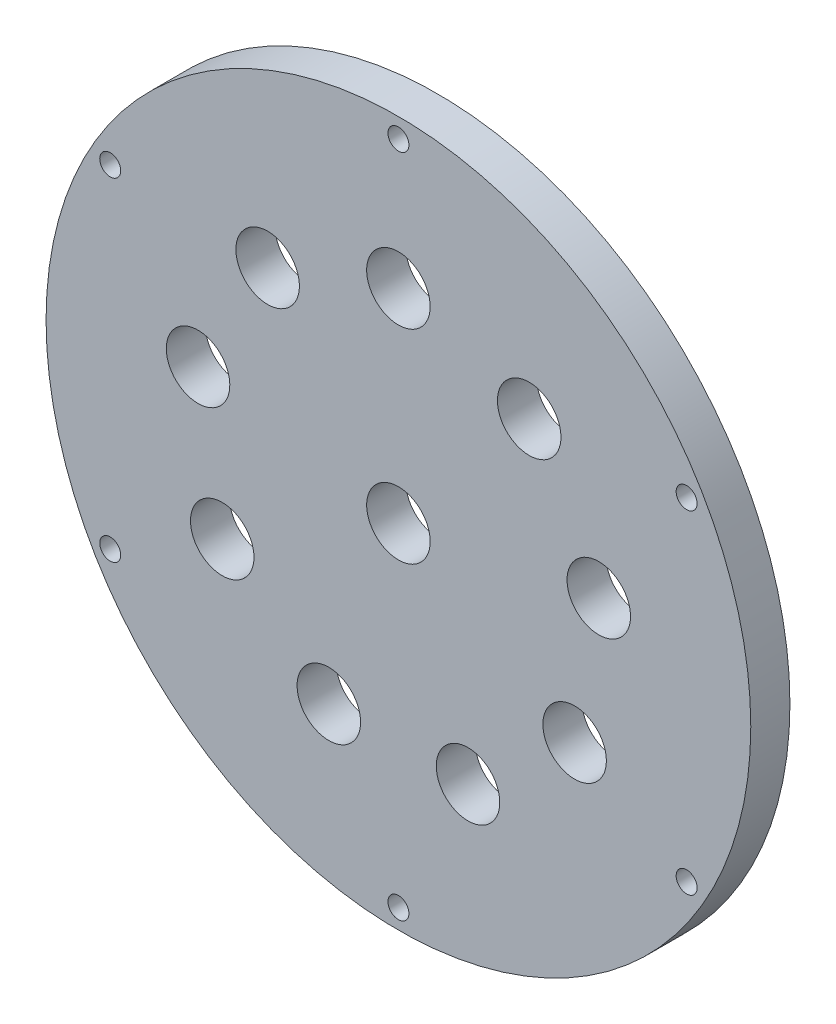
ISO-10303-21;
HEADER;
FILE_DESCRIPTION(('STEP AP214'),'2;1');
FILE_NAME('part.step','',(''),(''),'','','');
FILE_SCHEMA(('AUTOMOTIVE_DESIGN { 1 0 10303 214 1 1 1 1 }'));
ENDSEC;
DATA;
#1=APPLICATION_CONTEXT('core data for automotive mechanical design processes');
#2=APPLICATION_PROTOCOL_DEFINITION('international standard','automotive_design',2000,#1);
#3=PRODUCT_CONTEXT('',#1,'mechanical');
#4=PRODUCT('Part','Part','',(#3));
#5=PRODUCT_RELATED_PRODUCT_CATEGORY('part','',(#4));
#6=PRODUCT_DEFINITION_FORMATION('','',#4);
#7=PRODUCT_DEFINITION_CONTEXT('part definition',#1,'design');
#8=PRODUCT_DEFINITION('design','',#6,#7);
#9=PRODUCT_DEFINITION_SHAPE('','',#8);
#10=(LENGTH_UNIT() NAMED_UNIT(*) SI_UNIT(.MILLI.,.METRE.));
#11=(NAMED_UNIT(*) PLANE_ANGLE_UNIT() SI_UNIT($,.RADIAN.));
#12=(NAMED_UNIT(*) SI_UNIT($,.STERADIAN.) SOLID_ANGLE_UNIT());
#13=UNCERTAINTY_MEASURE_WITH_UNIT(LENGTH_MEASURE(1.E-05),#10,'distance_accuracy_value','');
#14=(GEOMETRIC_REPRESENTATION_CONTEXT(3) GLOBAL_UNCERTAINTY_ASSIGNED_CONTEXT((#13)) GLOBAL_UNIT_ASSIGNED_CONTEXT((#10,
#11,#12)) REPRESENTATION_CONTEXT('',''));
#15=CARTESIAN_POINT('',(0.,0.,0.));
#16=DIRECTION('',(0.,0.,1.));
#17=DIRECTION('',(1.,0.,0.));
#18=AXIS2_PLACEMENT_3D('',#15,#16,#17);
#19=CARTESIAN_POINT('',(0.,0.,6.35));
#20=DIRECTION('',(0.,0.,-1.));
#21=DIRECTION('',(-1.,0.,0.));
#22=AXIS2_PLACEMENT_3D('',#19,#20,#21);
#23=CYLINDRICAL_SURFACE('',#22,57.15);
#24=CARTESIAN_POINT('',(0.,0.,6.35));
#25=DIRECTION('',(0.,0.,1.));
#26=DIRECTION('',(1.,0.,0.));
#27=AXIS2_PLACEMENT_3D('',#24,#25,#26);
#28=CIRCLE('',#27,57.15);
#29=CARTESIAN_POINT('',(57.15,0.,6.35));
#30=VERTEX_POINT('',#29);
#31=EDGE_CURVE('E10',#30,#30,#28,.T.);
#32=ORIENTED_EDGE('',*,*,#31,.F.);
#33=EDGE_LOOP('',(#32));
#34=FACE_BOUND('',#33,.T.);
#35=CARTESIAN_POINT('',(0.,0.,0.));
#36=DIRECTION('',(0.,0.,1.));
#37=DIRECTION('',(1.,0.,0.));
#38=AXIS2_PLACEMENT_3D('',#35,#36,#37);
#39=CIRCLE('',#38,57.15);
#40=CARTESIAN_POINT('',(57.15,0.,0.));
#41=VERTEX_POINT('',#40);
#42=EDGE_CURVE('E44',#41,#41,#39,.T.);
#43=ORIENTED_EDGE('',*,*,#42,.T.);
#44=EDGE_LOOP('',(#43));
#45=FACE_BOUND('',#44,.T.);
#46=ADVANCED_FACE('F41',(#34,#45),#23,.T.);
#47=CARTESIAN_POINT('',(0.,0.,6.35));
#48=DIRECTION('',(0.,0.,1.));
#49=DIRECTION('',(1.,0.,0.));
#50=AXIS2_PLACEMENT_3D('',#47,#48,#49);
#51=PLANE('',#50);
#52=CARTESIAN_POINT('',(0.,0.,6.35));
#53=DIRECTION('',(0.,0.,1.));
#54=DIRECTION('',(1.,0.,0.));
#55=AXIS2_PLACEMENT_3D('',#52,#53,#54);
#56=CIRCLE('',#55,5.15);
#57=CARTESIAN_POINT('',(5.15,0.,6.35));
#58=VERTEX_POINT('',#57);
#59=EDGE_CURVE('E175',#58,#58,#56,.T.);
#60=ORIENTED_EDGE('',*,*,#59,.F.);
#61=EDGE_LOOP('',(#60));
#62=FACE_BOUND('',#61,.T.);
#63=CARTESIAN_POINT('',(-46.7437211692648,26.9875000000005,6.35));
#64=DIRECTION('',(0.,0.,1.));
#65=DIRECTION('',(0.50000000000001,0.866025403784433,0.));
#66=AXIS2_PLACEMENT_3D('',#63,#64,#65);
#67=CIRCLE('',#66,1.7);
#68=CARTESIAN_POINT('',(-45.8937211692647,28.4597431864341,6.35));
#69=VERTEX_POINT('',#68);
#70=EDGE_CURVE('E143',#69,#69,#67,.T.);
#71=ORIENTED_EDGE('',*,*,#70,.F.);
#72=EDGE_LOOP('',(#71));
#73=FACE_BOUND('',#72,.T.);
#74=CARTESIAN_POINT('',(-46.7437211692653,-26.9874999999996,6.35));
#75=DIRECTION('',(0.,0.,1.));
#76=DIRECTION('',(-0.499999999999992,0.866025403784443,0.));
#77=AXIS2_PLACEMENT_3D('',#74,#75,#76);
#78=CIRCLE('',#77,1.7);
#79=CARTESIAN_POINT('',(-47.5937211692653,-25.515256813566,6.35));
#80=VERTEX_POINT('',#79);
#81=EDGE_CURVE('E152',#80,#80,#78,.T.);
#82=ORIENTED_EDGE('',*,*,#81,.F.);
#83=EDGE_LOOP('',(#82));
#84=FACE_BOUND('',#83,.T.);
#85=CARTESIAN_POINT('',(0.,-53.975,6.35));
#86=DIRECTION('',(0.,0.,1.));
#87=DIRECTION('',(-1.,0.,0.));
#88=AXIS2_PLACEMENT_3D('',#85,#86,#87);
#89=CIRCLE('',#88,1.7);
#90=CARTESIAN_POINT('',(-1.7,-53.975,6.35));
#91=VERTEX_POINT('',#90);
#92=EDGE_CURVE('E160',#91,#91,#89,.T.);
#93=ORIENTED_EDGE('',*,*,#92,.F.);
#94=EDGE_LOOP('',(#93));
#95=FACE_BOUND('',#94,.T.);
#96=CARTESIAN_POINT('',(46.743721169265,-26.9875000000002,6.35));
#97=DIRECTION('',(0.,0.,1.));
#98=DIRECTION('',(-0.500000000000004,-0.866025403784436,0.));
#99=AXIS2_PLACEMENT_3D('',#96,#97,#98);
#100=CIRCLE('',#99,1.7);
#101=CARTESIAN_POINT('',(45.893721169265,-28.4597431864338,6.35));
#102=VERTEX_POINT('',#101);
#103=EDGE_CURVE('E168',#102,#102,#100,.T.);
#104=ORIENTED_EDGE('',*,*,#103,.F.);
#105=EDGE_LOOP('',(#104));
#106=FACE_BOUND('',#105,.T.);
#107=CARTESIAN_POINT('',(46.7437211692651,26.9874999999999,6.35));
#108=DIRECTION('',(0.,0.,1.));
#109=DIRECTION('',(0.499999999999998,-0.86602540378444,0.));
#110=AXIS2_PLACEMENT_3D('',#107,#108,#109);
#111=CIRCLE('',#110,1.7);
#112=CARTESIAN_POINT('',(47.5937211692651,25.5152568135663,6.35));
#113=VERTEX_POINT('',#112);
#114=EDGE_CURVE('E135',#113,#113,#111,.T.);
#115=ORIENTED_EDGE('',*,*,#114,.F.);
#116=EDGE_LOOP('',(#115));
#117=FACE_BOUND('',#116,.T.);
#118=CARTESIAN_POINT('',(0.,53.975,6.35));
#119=DIRECTION('',(0.,0.,1.));
#120=DIRECTION('',(1.,0.,0.));
#121=AXIS2_PLACEMENT_3D('',#118,#119,#120);
#122=CIRCLE('',#121,1.7);
#123=CARTESIAN_POINT('',(1.7,53.975,6.35));
#124=VERTEX_POINT('',#123);
#125=EDGE_CURVE('E127',#124,#124,#122,.T.);
#126=ORIENTED_EDGE('',*,*,#125,.F.);
#127=EDGE_LOOP('',(#126));
#128=FACE_BOUND('',#127,.T.);
#129=CARTESIAN_POINT('',(32.4986558494029,5.7303898630086,6.35));
#130=DIRECTION('',(0.,0.,1.));
#131=DIRECTION('',(0.173648177666927,-0.984807753012209,0.));
#132=AXIS2_PLACEMENT_3D('',#129,#130,#131);
#133=CIRCLE('',#132,5.15);
#134=CARTESIAN_POINT('',(33.3929439643876,0.658629934995728,6.35));
#135=VERTEX_POINT('',#134);
#136=EDGE_CURVE('E96',#135,#135,#133,.T.);
#137=ORIENTED_EDGE('',*,*,#136,.F.);
#138=EDGE_LOOP('',(#137));
#139=FACE_BOUND('',#138,.T.);
#140=CARTESIAN_POINT('',(28.5788383248864,-16.5000000000001,6.35));
#141=DIRECTION('',(0.,0.,1.));
#142=DIRECTION('',(-0.500000000000004,-0.866025403784436,0.));
#143=AXIS2_PLACEMENT_3D('',#140,#141,#142);
#144=CIRCLE('',#143,5.15);
#145=CARTESIAN_POINT('',(26.0038383248864,-20.96003082949,6.35));
#146=VERTEX_POINT('',#145);
#147=EDGE_CURVE('E88',#146,#146,#144,.T.);
#148=ORIENTED_EDGE('',*,*,#147,.F.);
#149=EDGE_LOOP('',(#148));
#150=FACE_BOUND('',#149,.T.);
#151=CARTESIAN_POINT('',(11.2866647297469,-31.0098564859351,6.35));
#152=DIRECTION('',(0.,0.,1.));
#153=DIRECTION('',(-0.939692620785911,-0.342020143325663,0.));
#154=AXIS2_PLACEMENT_3D('',#151,#152,#153);
#155=CIRCLE('',#154,5.15);
#156=CARTESIAN_POINT('',(6.44724773269944,-32.7712602240622,6.35));
#157=VERTEX_POINT('',#156);
#158=EDGE_CURVE('E80',#157,#157,#155,.T.);
#159=ORIENTED_EDGE('',*,*,#158,.F.);
#160=EDGE_LOOP('',(#159));
#161=FACE_BOUND('',#160,.T.);
#162=CARTESIAN_POINT('',(-11.2866647297473,-31.0098564859349,6.35));
#163=DIRECTION('',(0.,0.,1.));
#164=DIRECTION('',(-0.939692620785906,0.342020143325676,0.));
#165=AXIS2_PLACEMENT_3D('',#162,#163,#164);
#166=CIRCLE('',#165,5.15);
#167=CARTESIAN_POINT('',(-16.1260817267947,-29.2484527478077,6.35));
#168=VERTEX_POINT('',#167);
#169=EDGE_CURVE('E71',#168,#168,#166,.T.);
#170=ORIENTED_EDGE('',*,*,#169,.F.);
#171=EDGE_LOOP('',(#170));
#172=FACE_BOUND('',#171,.T.);
#173=CARTESIAN_POINT('',(-28.5788383248866,-16.4999999999997,6.35));
#174=DIRECTION('',(0.,0.,1.));
#175=DIRECTION('',(-0.499999999999992,0.866025403784443,0.));
#176=AXIS2_PLACEMENT_3D('',#173,#174,#175);
#177=CIRCLE('',#176,5.15);
#178=CARTESIAN_POINT('',(-31.1538383248866,-12.0399691705099,6.35));
#179=VERTEX_POINT('',#178);
#180=EDGE_CURVE('E120',#179,#179,#177,.T.);
#181=ORIENTED_EDGE('',*,*,#180,.F.);
#182=EDGE_LOOP('',(#181));
#183=FACE_BOUND('',#182,.T.);
#184=CARTESIAN_POINT('',(-32.4986558494028,5.73038986300904,6.35));
#185=DIRECTION('',(0.,0.,1.));
#186=DIRECTION('',(0.17364817766694,0.984807753012206,0.));
#187=AXIS2_PLACEMENT_3D('',#184,#185,#186);
#188=CIRCLE('',#187,5.15);
#189=CARTESIAN_POINT('',(-31.6043677344181,10.8021497910219,6.35));
#190=VERTEX_POINT('',#189);
#191=EDGE_CURVE('E112',#190,#190,#188,.T.);
#192=ORIENTED_EDGE('',*,*,#191,.F.);
#193=EDGE_LOOP('',(#192));
#194=FACE_BOUND('',#193,.T.);
#195=CARTESIAN_POINT('',(-21.2119911196555,25.2794666229265,6.35));
#196=DIRECTION('',(0.,0.,1.));
#197=DIRECTION('',(0.766044443118986,0.64278760968653,0.));
#198=AXIS2_PLACEMENT_3D('',#195,#196,#197);
#199=CIRCLE('',#198,5.15);
#200=CARTESIAN_POINT('',(-17.2668622375927,28.5898228128122,6.35));
#201=VERTEX_POINT('',#200);
#202=EDGE_CURVE('E103',#201,#201,#199,.T.);
#203=ORIENTED_EDGE('',*,*,#202,.F.);
#204=EDGE_LOOP('',(#203));
#205=FACE_BOUND('',#204,.T.);
#206=CARTESIAN_POINT('',(21.2119911196558,25.2794666229263,6.35));
#207=DIRECTION('',(0.,0.,1.));
#208=DIRECTION('',(0.766044443118977,-0.642787609686541,0.));
#209=AXIS2_PLACEMENT_3D('',#206,#207,#208);
#210=CIRCLE('',#209,5.15);
#211=CARTESIAN_POINT('',(25.1571200017186,21.9691104330406,6.35));
#212=VERTEX_POINT('',#211);
#213=EDGE_CURVE('E63',#212,#212,#210,.T.);
#214=ORIENTED_EDGE('',*,*,#213,.F.);
#215=EDGE_LOOP('',(#214));
#216=FACE_BOUND('',#215,.T.);
#217=CARTESIAN_POINT('',(0.,33.,6.35));
#218=DIRECTION('',(0.,0.,1.));
#219=DIRECTION('',(1.,0.,0.));
#220=AXIS2_PLACEMENT_3D('',#217,#218,#219);
#221=CIRCLE('',#220,5.15);
#222=CARTESIAN_POINT('',(5.15,33.,6.35));
#223=VERTEX_POINT('',#222);
#224=EDGE_CURVE('E55',#223,#223,#221,.T.);
#225=ORIENTED_EDGE('',*,*,#224,.F.);
#226=EDGE_LOOP('',(#225));
#227=FACE_BOUND('',#226,.T.);
#228=ORIENTED_EDGE('',*,*,#31,.T.);
#229=EDGE_LOOP('',(#228));
#230=FACE_BOUND('',#229,.T.);
#231=ADVANCED_FACE('F193',(#62,#73,#84,#95,#106,#117,#128,#139,#150,#161,#172,#183,#194,#205,
#216,#227,#230),#51,.T.);
#232=CARTESIAN_POINT('',(0.,0.,0.));
#233=DIRECTION('',(0.,0.,1.));
#234=DIRECTION('',(1.,0.,0.));
#235=AXIS2_PLACEMENT_3D('',#232,#233,#234);
#236=PLANE('',#235);
#237=CARTESIAN_POINT('',(0.,0.,0.));
#238=DIRECTION('',(0.,0.,1.));
#239=DIRECTION('',(1.,0.,0.));
#240=AXIS2_PLACEMENT_3D('',#237,#238,#239);
#241=CIRCLE('',#240,5.15);
#242=CARTESIAN_POINT('',(5.15,0.,0.));
#243=VERTEX_POINT('',#242);
#244=EDGE_CURVE('E148',#243,#243,#241,.T.);
#245=ORIENTED_EDGE('',*,*,#244,.T.);
#246=EDGE_LOOP('',(#245));
#247=FACE_BOUND('',#246,.T.);
#248=CARTESIAN_POINT('',(-46.7437211692648,26.9875000000005,0.));
#249=DIRECTION('',(0.,0.,1.));
#250=DIRECTION('',(0.50000000000001,0.866025403784433,0.));
#251=AXIS2_PLACEMENT_3D('',#248,#249,#250);
#252=CIRCLE('',#251,1.7);
#253=CARTESIAN_POINT('',(-45.8937211692647,28.4597431864341,0.));
#254=VERTEX_POINT('',#253);
#255=EDGE_CURVE('E147',#254,#254,#252,.T.);
#256=ORIENTED_EDGE('',*,*,#255,.T.);
#257=EDGE_LOOP('',(#256));
#258=FACE_BOUND('',#257,.T.);
#259=CARTESIAN_POINT('',(-46.7437211692653,-26.9874999999996,0.));
#260=DIRECTION('',(0.,0.,1.));
#261=DIRECTION('',(-0.499999999999992,0.866025403784443,0.));
#262=AXIS2_PLACEMENT_3D('',#259,#260,#261);
#263=CIRCLE('',#262,1.7);
#264=CARTESIAN_POINT('',(-47.5937211692653,-25.515256813566,0.));
#265=VERTEX_POINT('',#264);
#266=EDGE_CURVE('E156',#265,#265,#263,.T.);
#267=ORIENTED_EDGE('',*,*,#266,.T.);
#268=EDGE_LOOP('',(#267));
#269=FACE_BOUND('',#268,.T.);
#270=CARTESIAN_POINT('',(0.,-53.975,0.));
#271=DIRECTION('',(0.,0.,1.));
#272=DIRECTION('',(-1.,0.,0.));
#273=AXIS2_PLACEMENT_3D('',#270,#271,#272);
#274=CIRCLE('',#273,1.7);
#275=CARTESIAN_POINT('',(-1.7,-53.975,0.));
#276=VERTEX_POINT('',#275);
#277=EDGE_CURVE('E164',#276,#276,#274,.T.);
#278=ORIENTED_EDGE('',*,*,#277,.T.);
#279=EDGE_LOOP('',(#278));
#280=FACE_BOUND('',#279,.T.);
#281=CARTESIAN_POINT('',(46.743721169265,-26.9875000000002,0.));
#282=DIRECTION('',(0.,0.,1.));
#283=DIRECTION('',(-0.500000000000004,-0.866025403784436,0.));
#284=AXIS2_PLACEMENT_3D('',#281,#282,#283);
#285=CIRCLE('',#284,1.7);
#286=CARTESIAN_POINT('',(45.893721169265,-28.4597431864338,0.));
#287=VERTEX_POINT('',#286);
#288=EDGE_CURVE('E139',#287,#287,#285,.T.);
#289=ORIENTED_EDGE('',*,*,#288,.T.);
#290=EDGE_LOOP('',(#289));
#291=FACE_BOUND('',#290,.T.);
#292=CARTESIAN_POINT('',(46.7437211692651,26.9874999999999,0.));
#293=DIRECTION('',(0.,0.,1.));
#294=DIRECTION('',(0.499999999999998,-0.86602540378444,0.));
#295=AXIS2_PLACEMENT_3D('',#292,#293,#294);
#296=CIRCLE('',#295,1.7);
#297=CARTESIAN_POINT('',(47.5937211692651,25.5152568135663,0.));
#298=VERTEX_POINT('',#297);
#299=EDGE_CURVE('E131',#298,#298,#296,.T.);
#300=ORIENTED_EDGE('',*,*,#299,.T.);
#301=EDGE_LOOP('',(#300));
#302=FACE_BOUND('',#301,.T.);
#303=CARTESIAN_POINT('',(0.,53.975,0.));
#304=DIRECTION('',(0.,0.,1.));
#305=DIRECTION('',(1.,0.,0.));
#306=AXIS2_PLACEMENT_3D('',#303,#304,#305);
#307=CIRCLE('',#306,1.7);
#308=CARTESIAN_POINT('',(1.7,53.975,0.));
#309=VERTEX_POINT('',#308);
#310=EDGE_CURVE('E108',#309,#309,#307,.T.);
#311=ORIENTED_EDGE('',*,*,#310,.T.);
#312=EDGE_LOOP('',(#311));
#313=FACE_BOUND('',#312,.T.);
#314=CARTESIAN_POINT('',(32.4986558494029,5.7303898630086,0.));
#315=DIRECTION('',(0.,0.,1.));
#316=DIRECTION('',(0.173648177666927,-0.984807753012209,0.));
#317=AXIS2_PLACEMENT_3D('',#314,#315,#316);
#318=CIRCLE('',#317,5.15);
#319=CARTESIAN_POINT('',(33.3929439643876,0.658629934995728,0.));
#320=VERTEX_POINT('',#319);
#321=EDGE_CURVE('E67',#320,#320,#318,.T.);
#322=ORIENTED_EDGE('',*,*,#321,.T.);
#323=EDGE_LOOP('',(#322));
#324=FACE_BOUND('',#323,.T.);
#325=CARTESIAN_POINT('',(28.5788383248864,-16.5000000000001,0.));
#326=DIRECTION('',(0.,0.,1.));
#327=DIRECTION('',(-0.500000000000004,-0.866025403784436,0.));
#328=AXIS2_PLACEMENT_3D('',#325,#326,#327);
#329=CIRCLE('',#328,5.15);
#330=CARTESIAN_POINT('',(26.0038383248864,-20.96003082949,0.));
#331=VERTEX_POINT('',#330);
#332=EDGE_CURVE('E92',#331,#331,#329,.T.);
#333=ORIENTED_EDGE('',*,*,#332,.T.);
#334=EDGE_LOOP('',(#333));
#335=FACE_BOUND('',#334,.T.);
#336=CARTESIAN_POINT('',(11.2866647297469,-31.0098564859351,0.));
#337=DIRECTION('',(0.,0.,1.));
#338=DIRECTION('',(-0.939692620785911,-0.342020143325663,0.));
#339=AXIS2_PLACEMENT_3D('',#336,#337,#338);
#340=CIRCLE('',#339,5.15);
#341=CARTESIAN_POINT('',(6.44724773269944,-32.7712602240622,0.));
#342=VERTEX_POINT('',#341);
#343=EDGE_CURVE('E84',#342,#342,#340,.T.);
#344=ORIENTED_EDGE('',*,*,#343,.T.);
#345=EDGE_LOOP('',(#344));
#346=FACE_BOUND('',#345,.T.);
#347=CARTESIAN_POINT('',(-11.2866647297473,-31.0098564859349,0.));
#348=DIRECTION('',(0.,0.,1.));
#349=DIRECTION('',(-0.939692620785906,0.342020143325676,0.));
#350=AXIS2_PLACEMENT_3D('',#347,#348,#349);
#351=CIRCLE('',#350,5.15);
#352=CARTESIAN_POINT('',(-16.1260817267947,-29.2484527478077,0.));
#353=VERTEX_POINT('',#352);
#354=EDGE_CURVE('E75',#353,#353,#351,.T.);
#355=ORIENTED_EDGE('',*,*,#354,.T.);
#356=EDGE_LOOP('',(#355));
#357=FACE_BOUND('',#356,.T.);
#358=CARTESIAN_POINT('',(-28.5788383248866,-16.4999999999997,0.));
#359=DIRECTION('',(0.,0.,1.));
#360=DIRECTION('',(-0.499999999999992,0.866025403784443,0.));
#361=AXIS2_PLACEMENT_3D('',#358,#359,#360);
#362=CIRCLE('',#361,5.15);
#363=CARTESIAN_POINT('',(-31.1538383248866,-12.0399691705099,0.));
#364=VERTEX_POINT('',#363);
#365=EDGE_CURVE('E76',#364,#364,#362,.T.);
#366=ORIENTED_EDGE('',*,*,#365,.T.);
#367=EDGE_LOOP('',(#366));
#368=FACE_BOUND('',#367,.T.);
#369=CARTESIAN_POINT('',(-32.4986558494028,5.73038986300904,0.));
#370=DIRECTION('',(0.,0.,1.));
#371=DIRECTION('',(0.17364817766694,0.984807753012206,0.));
#372=AXIS2_PLACEMENT_3D('',#369,#370,#371);
#373=CIRCLE('',#372,5.15);
#374=CARTESIAN_POINT('',(-31.6043677344181,10.8021497910219,0.));
#375=VERTEX_POINT('',#374);
#376=EDGE_CURVE('E116',#375,#375,#373,.T.);
#377=ORIENTED_EDGE('',*,*,#376,.T.);
#378=EDGE_LOOP('',(#377));
#379=FACE_BOUND('',#378,.T.);
#380=CARTESIAN_POINT('',(-21.2119911196555,25.2794666229265,0.));
#381=DIRECTION('',(0.,0.,1.));
#382=DIRECTION('',(0.766044443118986,0.64278760968653,0.));
#383=AXIS2_PLACEMENT_3D('',#380,#381,#382);
#384=CIRCLE('',#383,5.15);
#385=CARTESIAN_POINT('',(-17.2668622375927,28.5898228128122,0.));
#386=VERTEX_POINT('',#385);
#387=EDGE_CURVE('E107',#386,#386,#384,.T.);
#388=ORIENTED_EDGE('',*,*,#387,.T.);
#389=EDGE_LOOP('',(#388));
#390=FACE_BOUND('',#389,.T.);
#391=CARTESIAN_POINT('',(21.2119911196558,25.2794666229263,0.));
#392=DIRECTION('',(0.,0.,1.));
#393=DIRECTION('',(0.766044443118977,-0.642787609686541,0.));
#394=AXIS2_PLACEMENT_3D('',#391,#392,#393);
#395=CIRCLE('',#394,5.15);
#396=CARTESIAN_POINT('',(25.1571200017186,21.9691104330406,0.));
#397=VERTEX_POINT('',#396);
#398=EDGE_CURVE('E59',#397,#397,#395,.T.);
#399=ORIENTED_EDGE('',*,*,#398,.T.);
#400=EDGE_LOOP('',(#399));
#401=FACE_BOUND('',#400,.T.);
#402=CARTESIAN_POINT('',(0.,33.,0.));
#403=DIRECTION('',(0.,0.,1.));
#404=DIRECTION('',(1.,0.,0.));
#405=AXIS2_PLACEMENT_3D('',#402,#403,#404);
#406=CIRCLE('',#405,5.15);
#407=CARTESIAN_POINT('',(5.15,33.,0.));
#408=VERTEX_POINT('',#407);
#409=EDGE_CURVE('E53',#408,#408,#406,.T.);
#410=ORIENTED_EDGE('',*,*,#409,.T.);
#411=EDGE_LOOP('',(#410));
#412=FACE_BOUND('',#411,.T.);
#413=ORIENTED_EDGE('',*,*,#42,.F.);
#414=EDGE_LOOP('',(#413));
#415=FACE_BOUND('',#414,.T.);
#416=ADVANCED_FACE('F183',(#247,#258,#269,#280,#291,#302,#313,#324,#335,#346,#357,#368,#379,
#390,#401,#412,#415),#236,.F.);
#417=CARTESIAN_POINT('',(0.,33.,0.));
#418=DIRECTION('',(0.,0.,1.));
#419=DIRECTION('',(1.,0.,0.));
#420=AXIS2_PLACEMENT_3D('',#417,#418,#419);
#421=CYLINDRICAL_SURFACE('',#420,5.15);
#422=ORIENTED_EDGE('',*,*,#409,.F.);
#423=EDGE_LOOP('',(#422));
#424=FACE_BOUND('',#423,.T.);
#425=ORIENTED_EDGE('',*,*,#224,.T.);
#426=EDGE_LOOP('',(#425));
#427=FACE_BOUND('',#426,.T.);
#428=ADVANCED_FACE('F227',(#424,#427),#421,.F.);
#429=CARTESIAN_POINT('',(21.2119911196558,25.2794666229263,0.));
#430=DIRECTION('',(0.,0.,1.));
#431=DIRECTION('',(1.,0.,0.));
#432=AXIS2_PLACEMENT_3D('',#429,#430,#431);
#433=CYLINDRICAL_SURFACE('',#432,5.15);
#434=ORIENTED_EDGE('',*,*,#398,.F.);
#435=EDGE_LOOP('',(#434));
#436=FACE_BOUND('',#435,.T.);
#437=ORIENTED_EDGE('',*,*,#213,.T.);
#438=EDGE_LOOP('',(#437));
#439=FACE_BOUND('',#438,.T.);
#440=ADVANCED_FACE('F229',(#436,#439),#433,.F.);
#441=CARTESIAN_POINT('',(-21.2119911196555,25.2794666229265,0.));
#442=DIRECTION('',(0.,0.,1.));
#443=DIRECTION('',(1.,0.,0.));
#444=AXIS2_PLACEMENT_3D('',#441,#442,#443);
#445=CYLINDRICAL_SURFACE('',#444,5.15);
#446=ORIENTED_EDGE('',*,*,#387,.F.);
#447=EDGE_LOOP('',(#446));
#448=FACE_BOUND('',#447,.T.);
#449=ORIENTED_EDGE('',*,*,#202,.T.);
#450=EDGE_LOOP('',(#449));
#451=FACE_BOUND('',#450,.T.);
#452=ADVANCED_FACE('F236',(#448,#451),#445,.F.);
#453=CARTESIAN_POINT('',(-32.4986558494028,5.73038986300904,0.));
#454=DIRECTION('',(0.,0.,1.));
#455=DIRECTION('',(1.,0.,0.));
#456=AXIS2_PLACEMENT_3D('',#453,#454,#455);
#457=CYLINDRICAL_SURFACE('',#456,5.15);
#458=ORIENTED_EDGE('',*,*,#376,.F.);
#459=EDGE_LOOP('',(#458));
#460=FACE_BOUND('',#459,.T.);
#461=ORIENTED_EDGE('',*,*,#191,.T.);
#462=EDGE_LOOP('',(#461));
#463=FACE_BOUND('',#462,.T.);
#464=ADVANCED_FACE('F352',(#460,#463),#457,.F.);
#465=CARTESIAN_POINT('',(-28.5788383248866,-16.4999999999997,0.));
#466=DIRECTION('',(0.,0.,1.));
#467=DIRECTION('',(1.,0.,0.));
#468=AXIS2_PLACEMENT_3D('',#465,#466,#467);
#469=CYLINDRICAL_SURFACE('',#468,5.15);
#470=ORIENTED_EDGE('',*,*,#365,.F.);
#471=EDGE_LOOP('',(#470));
#472=FACE_BOUND('',#471,.T.);
#473=ORIENTED_EDGE('',*,*,#180,.T.);
#474=EDGE_LOOP('',(#473));
#475=FACE_BOUND('',#474,.T.);
#476=ADVANCED_FACE('F344',(#472,#475),#469,.F.);
#477=CARTESIAN_POINT('',(-11.2866647297473,-31.0098564859349,0.));
#478=DIRECTION('',(0.,0.,1.));
#479=DIRECTION('',(1.,0.,0.));
#480=AXIS2_PLACEMENT_3D('',#477,#478,#479);
#481=CYLINDRICAL_SURFACE('',#480,5.15);
#482=ORIENTED_EDGE('',*,*,#354,.F.);
#483=EDGE_LOOP('',(#482));
#484=FACE_BOUND('',#483,.T.);
#485=ORIENTED_EDGE('',*,*,#169,.T.);
#486=EDGE_LOOP('',(#485));
#487=FACE_BOUND('',#486,.T.);
#488=ADVANCED_FACE('F336',(#484,#487),#481,.F.);
#489=CARTESIAN_POINT('',(11.2866647297469,-31.0098564859351,0.));
#490=DIRECTION('',(0.,0.,1.));
#491=DIRECTION('',(1.,0.,0.));
#492=AXIS2_PLACEMENT_3D('',#489,#490,#491);
#493=CYLINDRICAL_SURFACE('',#492,5.15);
#494=ORIENTED_EDGE('',*,*,#343,.F.);
#495=EDGE_LOOP('',(#494));
#496=FACE_BOUND('',#495,.T.);
#497=ORIENTED_EDGE('',*,*,#158,.T.);
#498=EDGE_LOOP('',(#497));
#499=FACE_BOUND('',#498,.T.);
#500=ADVANCED_FACE('F328',(#496,#499),#493,.F.);
#501=CARTESIAN_POINT('',(28.5788383248864,-16.5000000000001,0.));
#502=DIRECTION('',(0.,0.,1.));
#503=DIRECTION('',(1.,0.,0.));
#504=AXIS2_PLACEMENT_3D('',#501,#502,#503);
#505=CYLINDRICAL_SURFACE('',#504,5.15);
#506=ORIENTED_EDGE('',*,*,#332,.F.);
#507=EDGE_LOOP('',(#506));
#508=FACE_BOUND('',#507,.T.);
#509=ORIENTED_EDGE('',*,*,#147,.T.);
#510=EDGE_LOOP('',(#509));
#511=FACE_BOUND('',#510,.T.);
#512=ADVANCED_FACE('F320',(#508,#511),#505,.F.);
#513=CARTESIAN_POINT('',(32.4986558494029,5.7303898630086,0.));
#514=DIRECTION('',(0.,0.,1.));
#515=DIRECTION('',(1.,0.,0.));
#516=AXIS2_PLACEMENT_3D('',#513,#514,#515);
#517=CYLINDRICAL_SURFACE('',#516,5.15);
#518=ORIENTED_EDGE('',*,*,#321,.F.);
#519=EDGE_LOOP('',(#518));
#520=FACE_BOUND('',#519,.T.);
#521=ORIENTED_EDGE('',*,*,#136,.T.);
#522=EDGE_LOOP('',(#521));
#523=FACE_BOUND('',#522,.T.);
#524=ADVANCED_FACE('F312',(#520,#523),#517,.F.);
#525=CARTESIAN_POINT('',(0.,53.975,0.));
#526=DIRECTION('',(0.,0.,1.));
#527=DIRECTION('',(1.,0.,0.));
#528=AXIS2_PLACEMENT_3D('',#525,#526,#527);
#529=CYLINDRICAL_SURFACE('',#528,1.7);
#530=ORIENTED_EDGE('',*,*,#310,.F.);
#531=EDGE_LOOP('',(#530));
#532=FACE_BOUND('',#531,.T.);
#533=ORIENTED_EDGE('',*,*,#125,.T.);
#534=EDGE_LOOP('',(#533));
#535=FACE_BOUND('',#534,.T.);
#536=ADVANCED_FACE('F304',(#532,#535),#529,.F.);
#537=CARTESIAN_POINT('',(46.7437211692651,26.9874999999999,0.));
#538=DIRECTION('',(0.,0.,1.));
#539=DIRECTION('',(1.,0.,0.));
#540=AXIS2_PLACEMENT_3D('',#537,#538,#539);
#541=CYLINDRICAL_SURFACE('',#540,1.7);
#542=ORIENTED_EDGE('',*,*,#299,.F.);
#543=EDGE_LOOP('',(#542));
#544=FACE_BOUND('',#543,.T.);
#545=ORIENTED_EDGE('',*,*,#114,.T.);
#546=EDGE_LOOP('',(#545));
#547=FACE_BOUND('',#546,.T.);
#548=ADVANCED_FACE('F296',(#544,#547),#541,.F.);
#549=CARTESIAN_POINT('',(46.743721169265,-26.9875000000002,0.));
#550=DIRECTION('',(0.,0.,1.));
#551=DIRECTION('',(1.,0.,0.));
#552=AXIS2_PLACEMENT_3D('',#549,#550,#551);
#553=CYLINDRICAL_SURFACE('',#552,1.7);
#554=ORIENTED_EDGE('',*,*,#288,.F.);
#555=EDGE_LOOP('',(#554));
#556=FACE_BOUND('',#555,.T.);
#557=ORIENTED_EDGE('',*,*,#103,.T.);
#558=EDGE_LOOP('',(#557));
#559=FACE_BOUND('',#558,.T.);
#560=ADVANCED_FACE('F288',(#556,#559),#553,.F.);
#561=CARTESIAN_POINT('',(0.,-53.975,0.));
#562=DIRECTION('',(0.,0.,1.));
#563=DIRECTION('',(1.,0.,0.));
#564=AXIS2_PLACEMENT_3D('',#561,#562,#563);
#565=CYLINDRICAL_SURFACE('',#564,1.7);
#566=ORIENTED_EDGE('',*,*,#277,.F.);
#567=EDGE_LOOP('',(#566));
#568=FACE_BOUND('',#567,.T.);
#569=ORIENTED_EDGE('',*,*,#92,.T.);
#570=EDGE_LOOP('',(#569));
#571=FACE_BOUND('',#570,.T.);
#572=ADVANCED_FACE('F280',(#568,#571),#565,.F.);
#573=CARTESIAN_POINT('',(-46.7437211692653,-26.9874999999996,0.));
#574=DIRECTION('',(0.,0.,1.));
#575=DIRECTION('',(1.,0.,0.));
#576=AXIS2_PLACEMENT_3D('',#573,#574,#575);
#577=CYLINDRICAL_SURFACE('',#576,1.7);
#578=ORIENTED_EDGE('',*,*,#266,.F.);
#579=EDGE_LOOP('',(#578));
#580=FACE_BOUND('',#579,.T.);
#581=ORIENTED_EDGE('',*,*,#81,.T.);
#582=EDGE_LOOP('',(#581));
#583=FACE_BOUND('',#582,.T.);
#584=ADVANCED_FACE('F273',(#580,#583),#577,.F.);
#585=CARTESIAN_POINT('',(-46.7437211692648,26.9875000000005,0.));
#586=DIRECTION('',(0.,0.,1.));
#587=DIRECTION('',(1.,0.,0.));
#588=AXIS2_PLACEMENT_3D('',#585,#586,#587);
#589=CYLINDRICAL_SURFACE('',#588,1.7);
#590=ORIENTED_EDGE('',*,*,#255,.F.);
#591=EDGE_LOOP('',(#590));
#592=FACE_BOUND('',#591,.T.);
#593=ORIENTED_EDGE('',*,*,#70,.T.);
#594=EDGE_LOOP('',(#593));
#595=FACE_BOUND('',#594,.T.);
#596=ADVANCED_FACE('F189',(#592,#595),#589,.F.);
#597=CARTESIAN_POINT('',(0.,0.,0.));
#598=DIRECTION('',(0.,0.,1.));
#599=DIRECTION('',(1.,0.,0.));
#600=AXIS2_PLACEMENT_3D('',#597,#598,#599);
#601=CYLINDRICAL_SURFACE('',#600,5.15);
#602=ORIENTED_EDGE('',*,*,#244,.F.);
#603=EDGE_LOOP('',(#602));
#604=FACE_BOUND('',#603,.T.);
#605=ORIENTED_EDGE('',*,*,#59,.T.);
#606=EDGE_LOOP('',(#605));
#607=FACE_BOUND('',#606,.T.);
#608=ADVANCED_FACE('F186',(#604,#607),#601,.F.);
#609=CLOSED_SHELL('',(#46,#231,#416,#428,#440,#452,#464,#476,#488,#500,#512,#524,#536,#548,#560,
#572,#584,#596,#608));
#610=MANIFOLD_SOLID_BREP('B2',#609);
#611=ADVANCED_BREP_SHAPE_REPRESENTATION('',(#18,#610),#14);
#612=SHAPE_DEFINITION_REPRESENTATION(#9,#611);
ENDSEC;
END-ISO-10303-21;
